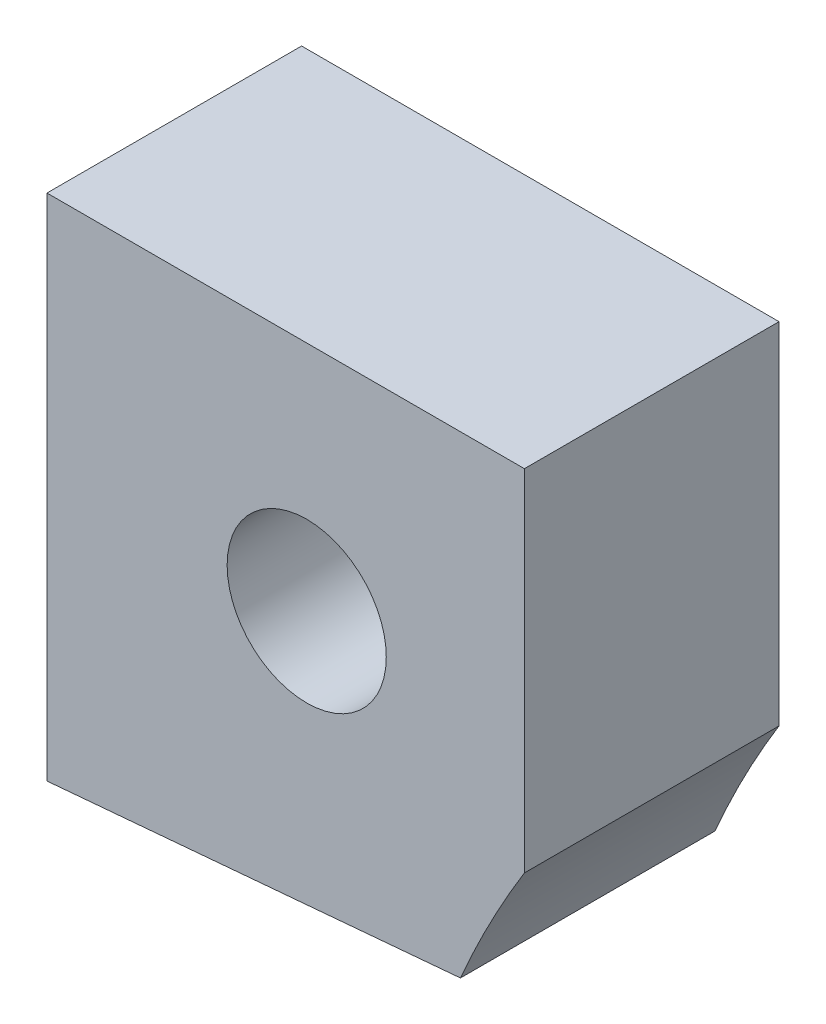
ISO-10303-21;
HEADER;
FILE_DESCRIPTION(('STEP AP214'),'2;1');
FILE_NAME('part.step','',(''),(''),'','','');
FILE_SCHEMA(('AUTOMOTIVE_DESIGN { 1 0 10303 214 1 1 1 1 }'));
ENDSEC;
DATA;
#1=APPLICATION_CONTEXT('core data for automotive mechanical design processes');
#2=APPLICATION_PROTOCOL_DEFINITION('international standard','automotive_design',2000,#1);
#3=PRODUCT_CONTEXT('',#1,'mechanical');
#4=PRODUCT('Part','Part','',(#3));
#5=PRODUCT_RELATED_PRODUCT_CATEGORY('part','',(#4));
#6=PRODUCT_DEFINITION_FORMATION('','',#4);
#7=PRODUCT_DEFINITION_CONTEXT('part definition',#1,'design');
#8=PRODUCT_DEFINITION('design','',#6,#7);
#9=PRODUCT_DEFINITION_SHAPE('','',#8);
#10=(LENGTH_UNIT() NAMED_UNIT(*) SI_UNIT(.MILLI.,.METRE.));
#11=(NAMED_UNIT(*) PLANE_ANGLE_UNIT() SI_UNIT($,.RADIAN.));
#12=(NAMED_UNIT(*) SI_UNIT($,.STERADIAN.) SOLID_ANGLE_UNIT());
#13=UNCERTAINTY_MEASURE_WITH_UNIT(LENGTH_MEASURE(1.E-05),#10,'distance_accuracy_value','');
#14=(GEOMETRIC_REPRESENTATION_CONTEXT(3) GLOBAL_UNCERTAINTY_ASSIGNED_CONTEXT((#13)) GLOBAL_UNIT_ASSIGNED_CONTEXT((#10,
#11,#12)) REPRESENTATION_CONTEXT('',''));
#15=CARTESIAN_POINT('',(0.,0.,0.));
#16=DIRECTION('',(0.,0.,1.));
#17=DIRECTION('',(1.,0.,0.));
#18=AXIS2_PLACEMENT_3D('',#15,#16,#17);
#19=CARTESIAN_POINT('',(19.4673656815589,3.70462795859914,8.));
#20=DIRECTION('',(0.,0.,-1.));
#21=DIRECTION('',(-1.,0.,0.));
#22=AXIS2_PLACEMENT_3D('',#19,#20,#21);
#23=CYLINDRICAL_SURFACE('',#22,1.5);
#24=CARTESIAN_POINT('',(19.4673656815589,3.70462795859914,0.));
#25=DIRECTION('',(0.,0.,1.));
#26=DIRECTION('',(1.,0.,0.));
#27=AXIS2_PLACEMENT_3D('',#24,#25,#26);
#28=CIRCLE('',#27,1.5);
#29=CARTESIAN_POINT('',(20.9673656815589,3.70462795859914,0.));
#30=VERTEX_POINT('',#29);
#31=EDGE_CURVE('E116',#30,#30,#28,.T.);
#32=ORIENTED_EDGE('',*,*,#31,.F.);
#33=EDGE_LOOP('',(#32));
#34=FACE_BOUND('',#33,.T.);
#35=CARTESIAN_POINT('',(19.4673656815589,3.70462795859914,4.));
#36=DIRECTION('',(0.,0.,1.));
#37=DIRECTION('',(1.,0.,0.));
#38=AXIS2_PLACEMENT_3D('',#35,#36,#37);
#39=CIRCLE('',#38,1.5);
#40=CARTESIAN_POINT('',(20.9673656815589,3.70462795859914,4.));
#41=VERTEX_POINT('',#40);
#42=EDGE_CURVE('E40',#41,#41,#39,.T.);
#43=ORIENTED_EDGE('',*,*,#42,.T.);
#44=EDGE_LOOP('',(#43));
#45=FACE_BOUND('',#44,.T.);
#46=ADVANCED_FACE('F36',(#34,#45),#23,.F.);
#47=CARTESIAN_POINT('',(51.8453488869669,-15.741071896822,8.));
#48=DIRECTION('',(0.,0.,-1.));
#49=DIRECTION('',(-1.,0.,0.));
#50=AXIS2_PLACEMENT_3D('',#47,#48,#49);
#51=PLANE('',#50);
#52=CARTESIAN_POINT('',(19.4673656815589,3.70462795859914,8.));
#53=DIRECTION('',(0.,0.,1.));
#54=DIRECTION('',(1.,0.,0.));
#55=AXIS2_PLACEMENT_3D('',#52,#53,#54);
#56=CIRCLE('',#55,2.5);
#57=CARTESIAN_POINT('',(21.9673656815589,3.70462795859914,8.));
#58=VERTEX_POINT('',#57);
#59=EDGE_CURVE('E214',#58,#58,#56,.T.);
#60=ORIENTED_EDGE('',*,*,#59,.F.);
#61=EDGE_LOOP('',(#60));
#62=FACE_BOUND('',#61,.T.);
#63=DIRECTION('',(-1.,0.,0.));
#64=VECTOR('',#63,1.);
#65=CARTESIAN_POINT('',(26.3067769703722,11.,8.));
#66=LINE('',#65,#64);
#67=CARTESIAN_POINT('',(26.3067769703722,11.,8.));
#68=VERTEX_POINT('',#67);
#69=CARTESIAN_POINT('',(11.3067769703722,11.,8.));
#70=VERTEX_POINT('',#69);
#71=EDGE_CURVE('E121',#68,#70,#66,.T.);
#72=ORIENTED_EDGE('',*,*,#71,.T.);
#73=DIRECTION('',(0.,-1.,0.));
#74=VECTOR('',#73,1.);
#75=CARTESIAN_POINT('',(11.3067769703722,11.,8.));
#76=LINE('',#75,#74);
#77=CARTESIAN_POINT('',(11.3067769703722,-5.,8.));
#78=VERTEX_POINT('',#77);
#79=EDGE_CURVE('E88',#70,#78,#76,.T.);
#80=ORIENTED_EDGE('',*,*,#79,.T.);
#81=DIRECTION('',(0.996194698091745,0.0871557427476619,0.));
#82=VECTOR('',#81,1.);
#83=CARTESIAN_POINT('',(11.3067769703722,-5.,8.));
#84=LINE('',#83,#82);
#85=CARTESIAN_POINT('',(24.2967769703722,-3.8635222607982,8.));
#86=VERTEX_POINT('',#85);
#87=EDGE_CURVE('E92',#78,#86,#84,.T.);
#88=ORIENTED_EDGE('',*,*,#87,.T.);
#89=CARTESIAN_POINT('',(51.8453488869669,-15.741071896822,8.));
#90=DIRECTION('',(0.,0.,-1.));
#91=DIRECTION('',(-1.,0.,0.));
#92=AXIS2_PLACEMENT_3D('',#89,#90,#91);
#93=CIRCLE('',#92,30.);
#94=CARTESIAN_POINT('',(26.3067769703722,0.,8.));
#95=VERTEX_POINT('',#94);
#96=EDGE_CURVE('E96',#86,#95,#93,.T.);
#97=ORIENTED_EDGE('',*,*,#96,.T.);
#98=DIRECTION('',(0.,1.,0.));
#99=VECTOR('',#98,1.);
#100=CARTESIAN_POINT('',(26.3067769703722,11.,8.));
#101=LINE('',#100,#99);
#102=EDGE_CURVE('E54',#95,#68,#101,.T.);
#103=ORIENTED_EDGE('',*,*,#102,.T.);
#104=EDGE_LOOP('',(#72,#80,#88,#97,#103));
#105=FACE_BOUND('',#104,.T.);
#106=ADVANCED_FACE('F94',(#62,#105),#51,.F.);
#107=CARTESIAN_POINT('',(51.8453488869669,-15.741071896822,0.));
#108=DIRECTION('',(0.,0.,-1.));
#109=DIRECTION('',(-1.,0.,0.));
#110=AXIS2_PLACEMENT_3D('',#107,#108,#109);
#111=PLANE('',#110);
#112=DIRECTION('',(-1.,0.,0.));
#113=VECTOR('',#112,1.);
#114=CARTESIAN_POINT('',(26.3067769703722,11.,0.));
#115=LINE('',#114,#113);
#116=CARTESIAN_POINT('',(26.3067769703722,11.,0.));
#117=VERTEX_POINT('',#116);
#118=CARTESIAN_POINT('',(11.3067769703722,11.,0.));
#119=VERTEX_POINT('',#118);
#120=EDGE_CURVE('E112',#117,#119,#115,.T.);
#121=ORIENTED_EDGE('',*,*,#120,.F.);
#122=DIRECTION('',(0.,1.,0.));
#123=VECTOR('',#122,1.);
#124=CARTESIAN_POINT('',(26.3067769703722,11.,0.));
#125=LINE('',#124,#123);
#126=CARTESIAN_POINT('',(26.3067769703722,0.,0.));
#127=VERTEX_POINT('',#126);
#128=EDGE_CURVE('E80',#127,#117,#125,.T.);
#129=ORIENTED_EDGE('',*,*,#128,.F.);
#130=CARTESIAN_POINT('',(51.8453488869669,-15.741071896822,0.));
#131=DIRECTION('',(0.,0.,-1.));
#132=DIRECTION('',(-1.,0.,0.));
#133=AXIS2_PLACEMENT_3D('',#130,#131,#132);
#134=CIRCLE('',#133,30.);
#135=CARTESIAN_POINT('',(24.2967769703722,-3.8635222607982,0.));
#136=VERTEX_POINT('',#135);
#137=EDGE_CURVE('E74',#136,#127,#134,.T.);
#138=ORIENTED_EDGE('',*,*,#137,.F.);
#139=DIRECTION('',(0.996194698091745,0.0871557427476619,0.));
#140=VECTOR('',#139,1.);
#141=CARTESIAN_POINT('',(11.3067769703722,-5.,0.));
#142=LINE('',#141,#140);
#143=CARTESIAN_POINT('',(11.3067769703722,-5.,0.));
#144=VERTEX_POINT('',#143);
#145=EDGE_CURVE('E103',#144,#136,#142,.T.);
#146=ORIENTED_EDGE('',*,*,#145,.F.);
#147=DIRECTION('',(0.,-1.,0.));
#148=VECTOR('',#147,1.);
#149=CARTESIAN_POINT('',(11.3067769703722,11.,0.));
#150=LINE('',#149,#148);
#151=EDGE_CURVE('E115',#119,#144,#150,.T.);
#152=ORIENTED_EDGE('',*,*,#151,.F.);
#153=EDGE_LOOP('',(#121,#129,#138,#146,#152));
#154=FACE_BOUND('',#153,.T.);
#155=ORIENTED_EDGE('',*,*,#31,.T.);
#156=EDGE_LOOP('',(#155));
#157=FACE_BOUND('',#156,.T.);
#158=ADVANCED_FACE('F126',(#154,#157),#111,.T.);
#159=CARTESIAN_POINT('',(26.3067769703722,11.,8.));
#160=DIRECTION('',(0.,-1.,0.));
#161=DIRECTION('',(1.,0.,0.));
#162=AXIS2_PLACEMENT_3D('',#159,#160,#161);
#163=PLANE('',#162);
#164=ORIENTED_EDGE('',*,*,#120,.T.);
#165=DIRECTION('',(0.,0.,-1.));
#166=VECTOR('',#165,1.);
#167=CARTESIAN_POINT('',(11.3067769703722,11.,8.));
#168=LINE('',#167,#166);
#169=EDGE_CURVE('E11',#70,#119,#168,.T.);
#170=ORIENTED_EDGE('',*,*,#169,.F.);
#171=ORIENTED_EDGE('',*,*,#71,.F.);
#172=DIRECTION('',(0.,0.,-1.));
#173=VECTOR('',#172,1.);
#174=CARTESIAN_POINT('',(26.3067769703722,11.,8.));
#175=LINE('',#174,#173);
#176=EDGE_CURVE('E108',#68,#117,#175,.T.);
#177=ORIENTED_EDGE('',*,*,#176,.T.);
#178=EDGE_LOOP('',(#164,#170,#171,#177));
#179=FACE_BOUND('',#178,.T.);
#180=ADVANCED_FACE('F38',(#179),#163,.F.);
#181=CARTESIAN_POINT('',(11.3067769703722,11.,8.));
#182=DIRECTION('',(1.,0.,0.));
#183=DIRECTION('',(0.,1.,0.));
#184=AXIS2_PLACEMENT_3D('',#181,#182,#183);
#185=PLANE('',#184);
#186=ORIENTED_EDGE('',*,*,#151,.T.);
#187=DIRECTION('',(0.,0.,-1.));
#188=VECTOR('',#187,1.);
#189=CARTESIAN_POINT('',(11.3067769703722,-5.,8.));
#190=LINE('',#189,#188);
#191=EDGE_CURVE('E46',#78,#144,#190,.T.);
#192=ORIENTED_EDGE('',*,*,#191,.F.);
#193=ORIENTED_EDGE('',*,*,#79,.F.);
#194=ORIENTED_EDGE('',*,*,#169,.T.);
#195=EDGE_LOOP('',(#186,#192,#193,#194));
#196=FACE_BOUND('',#195,.T.);
#197=ADVANCED_FACE('F159',(#196),#185,.F.);
#198=CARTESIAN_POINT('',(11.3067769703722,-5.,8.));
#199=DIRECTION('',(-0.0871557427476619,0.996194698091745,0.));
#200=DIRECTION('',(-0.996194698091745,-0.0871557427476619,0.));
#201=AXIS2_PLACEMENT_3D('',#198,#199,#200);
#202=PLANE('',#201);
#203=ORIENTED_EDGE('',*,*,#145,.T.);
#204=DIRECTION('',(0.,0.,-1.));
#205=VECTOR('',#204,1.);
#206=CARTESIAN_POINT('',(24.2967769703722,-3.8635222607982,8.));
#207=LINE('',#206,#205);
#208=EDGE_CURVE('E100',#86,#136,#207,.T.);
#209=ORIENTED_EDGE('',*,*,#208,.F.);
#210=ORIENTED_EDGE('',*,*,#87,.F.);
#211=ORIENTED_EDGE('',*,*,#191,.T.);
#212=EDGE_LOOP('',(#203,#209,#210,#211));
#213=FACE_BOUND('',#212,.T.);
#214=ADVANCED_FACE('F101',(#213),#202,.F.);
#215=CARTESIAN_POINT('',(51.8453488869669,-15.741071896822,8.));
#216=DIRECTION('',(0.,0.,-1.));
#217=DIRECTION('',(-1.,0.,0.));
#218=AXIS2_PLACEMENT_3D('',#215,#216,#217);
#219=CYLINDRICAL_SURFACE('',#218,30.);
#220=ORIENTED_EDGE('',*,*,#137,.T.);
#221=DIRECTION('',(0.,0.,-1.));
#222=VECTOR('',#221,1.);
#223=CARTESIAN_POINT('',(26.3067769703722,0.,8.));
#224=LINE('',#223,#222);
#225=EDGE_CURVE('E104',#95,#127,#224,.T.);
#226=ORIENTED_EDGE('',*,*,#225,.F.);
#227=ORIENTED_EDGE('',*,*,#96,.F.);
#228=ORIENTED_EDGE('',*,*,#208,.T.);
#229=EDGE_LOOP('',(#220,#226,#227,#228));
#230=FACE_BOUND('',#229,.T.);
#231=ADVANCED_FACE('F106',(#230),#219,.F.);
#232=CARTESIAN_POINT('',(26.3067769703722,11.,8.));
#233=DIRECTION('',(-1.,0.,0.));
#234=DIRECTION('',(0.,-1.,0.));
#235=AXIS2_PLACEMENT_3D('',#232,#233,#234);
#236=PLANE('',#235);
#237=ORIENTED_EDGE('',*,*,#128,.T.);
#238=ORIENTED_EDGE('',*,*,#176,.F.);
#239=ORIENTED_EDGE('',*,*,#102,.F.);
#240=ORIENTED_EDGE('',*,*,#225,.T.);
#241=EDGE_LOOP('',(#237,#238,#239,#240));
#242=FACE_BOUND('',#241,.T.);
#243=ADVANCED_FACE('F131',(#242),#236,.F.);
#244=CARTESIAN_POINT('',(19.4673656815589,3.70462795859914,4.));
#245=DIRECTION('',(0.,0.,1.));
#246=DIRECTION('',(1.,0.,0.));
#247=AXIS2_PLACEMENT_3D('',#244,#245,#246);
#248=CYLINDRICAL_SURFACE('',#247,2.5);
#249=CARTESIAN_POINT('',(19.4673656815589,3.70462795859914,4.));
#250=DIRECTION('',(0.,0.,1.));
#251=DIRECTION('',(1.,0.,0.));
#252=AXIS2_PLACEMENT_3D('',#249,#250,#251);
#253=CIRCLE('',#252,2.5);
#254=CARTESIAN_POINT('',(21.9673656815589,3.70462795859914,4.));
#255=VERTEX_POINT('',#254);
#256=EDGE_CURVE('E213',#255,#255,#253,.T.);
#257=ORIENTED_EDGE('',*,*,#256,.F.);
#258=EDGE_LOOP('',(#257));
#259=FACE_BOUND('',#258,.T.);
#260=ORIENTED_EDGE('',*,*,#59,.T.);
#261=EDGE_LOOP('',(#260));
#262=FACE_BOUND('',#261,.T.);
#263=ADVANCED_FACE('F133',(#259,#262),#248,.F.);
#264=CARTESIAN_POINT('',(19.4673656815589,3.70462795859914,4.));
#265=DIRECTION('',(0.,0.,1.));
#266=DIRECTION('',(1.,0.,0.));
#267=AXIS2_PLACEMENT_3D('',#264,#265,#266);
#268=PLANE('',#267);
#269=ORIENTED_EDGE('',*,*,#42,.F.);
#270=EDGE_LOOP('',(#269));
#271=FACE_BOUND('',#270,.T.);
#272=ORIENTED_EDGE('',*,*,#256,.T.);
#273=EDGE_LOOP('',(#272));
#274=FACE_BOUND('',#273,.T.);
#275=ADVANCED_FACE('F139',(#271,#274),#268,.T.);
#276=CLOSED_SHELL('',(#46,#106,#158,#180,#197,#214,#231,#243,#263,#275));
#277=MANIFOLD_SOLID_BREP('B2',#276);
#278=ADVANCED_BREP_SHAPE_REPRESENTATION('',(#18,#277),#14);
#279=SHAPE_DEFINITION_REPRESENTATION(#9,#278);
ENDSEC;
END-ISO-10303-21;
